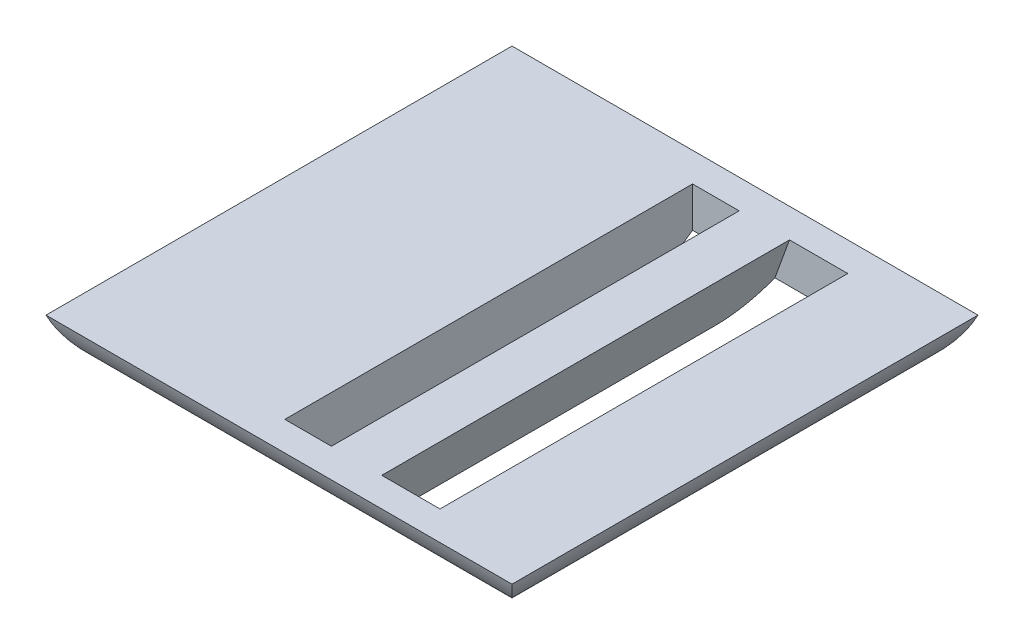
ISO-10303-21;
HEADER;
FILE_DESCRIPTION(('STEP AP214'),'2;1');
FILE_NAME('part.step','',(''),(''),'','','');
FILE_SCHEMA(('AUTOMOTIVE_DESIGN { 1 0 10303 214 1 1 1 1 }'));
ENDSEC;
DATA;
#1=APPLICATION_CONTEXT('core data for automotive mechanical design processes');
#2=APPLICATION_PROTOCOL_DEFINITION('international standard','automotive_design',2000,#1);
#3=PRODUCT_CONTEXT('',#1,'mechanical');
#4=PRODUCT('Part','Part','',(#3));
#5=PRODUCT_RELATED_PRODUCT_CATEGORY('part','',(#4));
#6=PRODUCT_DEFINITION_FORMATION('','',#4);
#7=PRODUCT_DEFINITION_CONTEXT('part definition',#1,'design');
#8=PRODUCT_DEFINITION('design','',#6,#7);
#9=PRODUCT_DEFINITION_SHAPE('','',#8);
#10=(LENGTH_UNIT() NAMED_UNIT(*) SI_UNIT(.MILLI.,.METRE.));
#11=(NAMED_UNIT(*) PLANE_ANGLE_UNIT() SI_UNIT($,.RADIAN.));
#12=(NAMED_UNIT(*) SI_UNIT($,.STERADIAN.) SOLID_ANGLE_UNIT());
#13=UNCERTAINTY_MEASURE_WITH_UNIT(LENGTH_MEASURE(1.E-05),#10,'distance_accuracy_value','');
#14=(GEOMETRIC_REPRESENTATION_CONTEXT(3) GLOBAL_UNCERTAINTY_ASSIGNED_CONTEXT((#13)) GLOBAL_UNIT_ASSIGNED_CONTEXT((#10,
#11,#12)) REPRESENTATION_CONTEXT('',''));
#15=CARTESIAN_POINT('',(0.,0.,0.));
#16=DIRECTION('',(0.,0.,1.));
#17=DIRECTION('',(1.,0.,0.));
#18=AXIS2_PLACEMENT_3D('',#15,#16,#17);
#19=CARTESIAN_POINT('',(0.,0.,0.));
#20=DIRECTION('',(0.,1.,0.));
#21=DIRECTION('',(0.,0.,1.));
#22=AXIS2_PLACEMENT_3D('',#19,#20,#21);
#23=PLANE('',#22);
#24=DIRECTION('',(0.,0.,1.));
#25=VECTOR('',#24,1.);
#26=CARTESIAN_POINT('',(4.,0.,-35.));
#27=LINE('',#26,#25);
#28=CARTESIAN_POINT('',(4.,0.,-25.857864376269));
#29=VERTEX_POINT('',#28);
#30=CARTESIAN_POINT('',(4.,0.,25.8578643762691));
#31=VERTEX_POINT('',#30);
#32=EDGE_CURVE('E189',#29,#31,#27,.T.);
#33=ORIENTED_EDGE('',*,*,#32,.F.);
#34=DIRECTION('',(-1.,0.,0.));
#35=VECTOR('',#34,1.);
#36=CARTESIAN_POINT('',(0.,0.,-25.857864376269));
#37=LINE('',#36,#35);
#38=CARTESIAN_POINT('',(9.,0.,-25.857864376269));
#39=VERTEX_POINT('',#38);
#40=EDGE_CURVE('E237',#29,#39,#37,.F.);
#41=ORIENTED_EDGE('',*,*,#40,.T.);
#42=DIRECTION('',(0.,0.,-1.));
#43=VECTOR('',#42,1.);
#44=CARTESIAN_POINT('',(9.00000000000001,0.,35.0000000000001));
#45=LINE('',#44,#43);
#46=CARTESIAN_POINT('',(9.00000000000001,0.,25.8578643762691));
#47=VERTEX_POINT('',#46);
#48=EDGE_CURVE('E171',#47,#39,#45,.T.);
#49=ORIENTED_EDGE('',*,*,#48,.F.);
#50=DIRECTION('',(1.,0.,0.));
#51=VECTOR('',#50,1.);
#52=CARTESIAN_POINT('',(0.,0.,25.8578643762691));
#53=LINE('',#52,#51);
#54=EDGE_CURVE('E229',#47,#31,#53,.F.);
#55=ORIENTED_EDGE('',*,*,#54,.T.);
#56=EDGE_LOOP('',(#33,#41,#49,#55));
#57=FACE_BOUND('',#56,.T.);
#58=ADVANCED_FACE('F35',(#57),#23,.F.);
#59=DIRECTION('',(0.,0.,-1.));
#60=VECTOR('',#59,1.);
#61=CARTESIAN_POINT('',(19.,0.,35.0000000000001));
#62=LINE('',#61,#60);
#63=CARTESIAN_POINT('',(19.,0.,25.8578643762691));
#64=VERTEX_POINT('',#63);
#65=CARTESIAN_POINT('',(19.,0.,-25.857864376269));
#66=VERTEX_POINT('',#65);
#67=EDGE_CURVE('E181',#64,#66,#62,.T.);
#68=ORIENTED_EDGE('',*,*,#67,.T.);
#69=DIRECTION('',(-1.,0.,0.));
#70=VECTOR('',#69,1.);
#71=CARTESIAN_POINT('',(0.,0.,-25.857864376269));
#72=LINE('',#71,#70);
#73=CARTESIAN_POINT('',(25.8578643762691,0.,-25.857864376269));
#74=VERTEX_POINT('',#73);
#75=EDGE_CURVE('E235',#66,#74,#72,.F.);
#76=ORIENTED_EDGE('',*,*,#75,.T.);
#77=DIRECTION('',(0.,0.,-1.));
#78=VECTOR('',#77,1.);
#79=CARTESIAN_POINT('',(25.8578643762691,0.,0.));
#80=LINE('',#79,#78);
#81=CARTESIAN_POINT('',(25.8578643762691,0.,25.8578643762691));
#82=VERTEX_POINT('',#81);
#83=EDGE_CURVE('E233',#74,#82,#80,.F.);
#84=ORIENTED_EDGE('',*,*,#83,.T.);
#85=DIRECTION('',(1.,0.,0.));
#86=VECTOR('',#85,1.);
#87=CARTESIAN_POINT('',(0.,0.,25.8578643762691));
#88=LINE('',#87,#86);
#89=EDGE_CURVE('E231',#82,#64,#88,.F.);
#90=ORIENTED_EDGE('',*,*,#89,.T.);
#91=EDGE_LOOP('',(#68,#76,#84,#90));
#92=FACE_BOUND('',#91,.T.);
#93=ADVANCED_FACE('F282',(#92),#23,.F.);
#94=CARTESIAN_POINT('',(19.,0.,35.0000000000001));
#95=DIRECTION('',(0.939692620785907,-0.342020143325673,0.));
#96=DIRECTION('',(0.342020143325673,0.939692620785907,0.));
#97=AXIS2_PLACEMENT_3D('',#94,#95,#96);
#98=PLANE('',#97);
#99=DIRECTION('',(-0.342020143325673,-0.939692620785907,0.));
#100=VECTOR('',#99,1.);
#101=CARTESIAN_POINT('',(22.6397023426621,10.,-35.));
#102=LINE('',#101,#100);
#103=CARTESIAN_POINT('',(22.6397023426621,10.,-35.));
#104=VERTEX_POINT('',#103);
#105=CARTESIAN_POINT('',(20.1311935916073,3.10792884997279,-35.));
#106=VERTEX_POINT('',#105);
#107=EDGE_CURVE('E160',#104,#106,#102,.T.);
#108=ORIENTED_EDGE('',*,*,#107,.T.);
#109=CARTESIAN_POINT('',(24.4595535139931,15.,-25.857864376269));
#110=DIRECTION('',(0.939692620785907,-0.342020143325673,0.));
#111=DIRECTION('',(-0.342020143325673,-0.939692620785907,0.));
#112=AXIS2_PLACEMENT_3D('',#109,#110,#111);
#113=ELLIPSE('',#112,15.9626665871387,15.);
#114=EDGE_CURVE('E255',#106,#66,#113,.F.);
#115=ORIENTED_EDGE('',*,*,#114,.T.);
#116=ORIENTED_EDGE('',*,*,#67,.F.);
#117=CARTESIAN_POINT('',(24.4595535139931,15.,25.8578643762691));
#118=DIRECTION('',(0.939692620785907,-0.342020143325673,0.));
#119=DIRECTION('',(0.342020143325673,0.939692620785907,0.));
#120=AXIS2_PLACEMENT_3D('',#117,#118,#119);
#121=ELLIPSE('',#120,15.9626665871387,15.);
#122=CARTESIAN_POINT('',(20.1311935916073,3.10792884997281,35.0000000000001));
#123=VERTEX_POINT('',#122);
#124=EDGE_CURVE('E52',#64,#123,#121,.F.);
#125=ORIENTED_EDGE('',*,*,#124,.T.);
#126=DIRECTION('',(-0.342020143325673,-0.939692620785907,0.));
#127=VECTOR('',#126,1.);
#128=CARTESIAN_POINT('',(19.,0.,35.0000000000001));
#129=LINE('',#128,#127);
#130=CARTESIAN_POINT('',(22.6397023426621,10.,35.));
#131=VERTEX_POINT('',#130);
#132=EDGE_CURVE('E176',#131,#123,#129,.T.);
#133=ORIENTED_EDGE('',*,*,#132,.F.);
#134=DIRECTION('',(0.,0.,-1.));
#135=VECTOR('',#134,1.);
#136=CARTESIAN_POINT('',(22.6397023426621,10.,35.));
#137=LINE('',#136,#135);
#138=EDGE_CURVE('E170',#131,#104,#137,.T.);
#139=ORIENTED_EDGE('',*,*,#138,.T.);
#140=EDGE_LOOP('',(#108,#115,#116,#125,#133,#139));
#141=FACE_BOUND('',#140,.T.);
#142=ADVANCED_FACE('F276',(#141),#98,.F.);
#143=CARTESIAN_POINT('',(9.00000000000001,0.,35.0000000000001));
#144=DIRECTION('',(-0.939692620785907,0.342020143325673,0.));
#145=DIRECTION('',(-0.342020143325673,-0.939692620785907,0.));
#146=AXIS2_PLACEMENT_3D('',#143,#144,#145);
#147=PLANE('',#146);
#148=ORIENTED_EDGE('',*,*,#48,.T.);
#149=CARTESIAN_POINT('',(14.4595535139931,15.,-25.857864376269));
#150=DIRECTION('',(-0.939692620785907,0.342020143325673,0.));
#151=DIRECTION('',(-0.342020143325673,-0.939692620785907,0.));
#152=AXIS2_PLACEMENT_3D('',#149,#150,#151);
#153=ELLIPSE('',#152,15.9626665871387,15.);
#154=CARTESIAN_POINT('',(10.1311935916073,3.10792884997278,-35.));
#155=VERTEX_POINT('',#154);
#156=EDGE_CURVE('E251',#39,#155,#153,.F.);
#157=ORIENTED_EDGE('',*,*,#156,.T.);
#158=DIRECTION('',(0.342020143325673,0.939692620785907,0.));
#159=VECTOR('',#158,1.);
#160=CARTESIAN_POINT('',(9.,0.,-35.));
#161=LINE('',#160,#159);
#162=CARTESIAN_POINT('',(12.6397023426621,10.,-35.));
#163=VERTEX_POINT('',#162);
#164=EDGE_CURVE('E166',#155,#163,#161,.T.);
#165=ORIENTED_EDGE('',*,*,#164,.T.);
#166=DIRECTION('',(0.,0.,-1.));
#167=VECTOR('',#166,1.);
#168=CARTESIAN_POINT('',(12.6397023426621,10.,35.0000000000001));
#169=LINE('',#168,#167);
#170=CARTESIAN_POINT('',(12.6397023426621,10.,35.0000000000001));
#171=VERTEX_POINT('',#170);
#172=EDGE_CURVE('E163',#171,#163,#169,.T.);
#173=ORIENTED_EDGE('',*,*,#172,.F.);
#174=DIRECTION('',(0.342020143325673,0.939692620785907,0.));
#175=VECTOR('',#174,1.);
#176=CARTESIAN_POINT('',(9.00000000000001,0.,35.0000000000001));
#177=LINE('',#176,#175);
#178=CARTESIAN_POINT('',(10.1311935916073,3.10792884997282,35.0000000000001));
#179=VERTEX_POINT('',#178);
#180=EDGE_CURVE('E152',#179,#171,#177,.T.);
#181=ORIENTED_EDGE('',*,*,#180,.F.);
#182=CARTESIAN_POINT('',(14.4595535139931,15.,25.8578643762691));
#183=DIRECTION('',(-0.939692620785907,0.342020143325673,0.));
#184=DIRECTION('',(0.342020143325673,0.939692620785907,0.));
#185=AXIS2_PLACEMENT_3D('',#182,#183,#184);
#186=ELLIPSE('',#185,15.9626665871387,15.);
#187=EDGE_CURVE('E249',#179,#47,#186,.F.);
#188=ORIENTED_EDGE('',*,*,#187,.T.);
#189=EDGE_LOOP('',(#148,#157,#165,#173,#181,#188));
#190=FACE_BOUND('',#189,.T.);
#191=ADVANCED_FACE('F165',(#190),#147,.F.);
#192=CARTESIAN_POINT('',(0.,10.,0.));
#193=DIRECTION('',(0.,1.,0.));
#194=DIRECTION('',(0.,0.,1.));
#195=AXIS2_PLACEMENT_3D('',#192,#193,#194);
#196=PLANE('',#195);
#197=DIRECTION('',(-1.,0.,0.));
#198=VECTOR('',#197,1.);
#199=CARTESIAN_POINT('',(40.,10.,-40.));
#200=LINE('',#199,#198);
#201=CARTESIAN_POINT('',(40.,10.,-40.));
#202=VERTEX_POINT('',#201);
#203=CARTESIAN_POINT('',(-40.,10.,-40.));
#204=VERTEX_POINT('',#203);
#205=EDGE_CURVE('E220',#202,#204,#200,.T.);
#206=ORIENTED_EDGE('',*,*,#205,.T.);
#207=DIRECTION('',(0.,0.,1.));
#208=VECTOR('',#207,1.);
#209=CARTESIAN_POINT('',(-40.,10.,40.));
#210=LINE('',#209,#208);
#211=CARTESIAN_POINT('',(-40.,10.,40.));
#212=VERTEX_POINT('',#211);
#213=EDGE_CURVE('E213',#204,#212,#210,.T.);
#214=ORIENTED_EDGE('',*,*,#213,.T.);
#215=DIRECTION('',(1.,0.,0.));
#216=VECTOR('',#215,1.);
#217=CARTESIAN_POINT('',(40.,10.,40.));
#218=LINE('',#217,#216);
#219=CARTESIAN_POINT('',(40.,10.,40.));
#220=VERTEX_POINT('',#219);
#221=EDGE_CURVE('E216',#212,#220,#218,.T.);
#222=ORIENTED_EDGE('',*,*,#221,.T.);
#223=DIRECTION('',(0.,0.,-1.));
#224=VECTOR('',#223,1.);
#225=CARTESIAN_POINT('',(40.,10.,40.));
#226=LINE('',#225,#224);
#227=EDGE_CURVE('E218',#220,#202,#226,.T.);
#228=ORIENTED_EDGE('',*,*,#227,.T.);
#229=EDGE_LOOP('',(#206,#214,#222,#228));
#230=FACE_BOUND('',#229,.T.);
#231=ORIENTED_EDGE('',*,*,#138,.F.);
#232=DIRECTION('',(1.,0.,0.));
#233=VECTOR('',#232,1.);
#234=CARTESIAN_POINT('',(12.6397023426621,10.,35.0000000000001));
#235=LINE('',#234,#233);
#236=EDGE_CURVE('E156',#171,#131,#235,.T.);
#237=ORIENTED_EDGE('',*,*,#236,.F.);
#238=ORIENTED_EDGE('',*,*,#172,.T.);
#239=DIRECTION('',(1.,0.,0.));
#240=VECTOR('',#239,1.);
#241=CARTESIAN_POINT('',(12.6397023426621,10.,-35.));
#242=LINE('',#241,#240);
#243=EDGE_CURVE('E272',#163,#104,#242,.T.);
#244=ORIENTED_EDGE('',*,*,#243,.T.);
#245=EDGE_LOOP('',(#231,#237,#238,#244));
#246=FACE_BOUND('',#245,.T.);
#247=DIRECTION('',(0.,0.,1.));
#248=VECTOR('',#247,1.);
#249=CARTESIAN_POINT('',(-4.,10.,0.));
#250=LINE('',#249,#248);
#251=CARTESIAN_POINT('',(-4.,10.,-35.));
#252=VERTEX_POINT('',#251);
#253=CARTESIAN_POINT('',(-4.,10.,35.));
#254=VERTEX_POINT('',#253);
#255=EDGE_CURVE('E211',#252,#254,#250,.T.);
#256=ORIENTED_EDGE('',*,*,#255,.F.);
#257=DIRECTION('',(-1.,0.,0.));
#258=VECTOR('',#257,1.);
#259=CARTESIAN_POINT('',(0.,10.,-35.));
#260=LINE('',#259,#258);
#261=CARTESIAN_POINT('',(4.,10.,-35.));
#262=VERTEX_POINT('',#261);
#263=EDGE_CURVE('E196',#262,#252,#260,.T.);
#264=ORIENTED_EDGE('',*,*,#263,.F.);
#265=DIRECTION('',(0.,0.,-1.));
#266=VECTOR('',#265,1.);
#267=CARTESIAN_POINT('',(4.,10.,0.));
#268=LINE('',#267,#266);
#269=CARTESIAN_POINT('',(4.,10.,35.));
#270=VERTEX_POINT('',#269);
#271=EDGE_CURVE('E206',#270,#262,#268,.T.);
#272=ORIENTED_EDGE('',*,*,#271,.F.);
#273=DIRECTION('',(1.,0.,0.));
#274=VECTOR('',#273,1.);
#275=CARTESIAN_POINT('',(0.,10.,35.));
#276=LINE('',#275,#274);
#277=EDGE_CURVE('E209',#254,#270,#276,.T.);
#278=ORIENTED_EDGE('',*,*,#277,.F.);
#279=EDGE_LOOP('',(#256,#264,#272,#278));
#280=FACE_BOUND('',#279,.T.);
#281=ADVANCED_FACE('F174',(#230,#246,#280),#196,.T.);
#282=DIRECTION('',(0.,0.,1.));
#283=VECTOR('',#282,1.);
#284=CARTESIAN_POINT('',(-25.857864376269,0.,0.));
#285=LINE('',#284,#283);
#286=CARTESIAN_POINT('',(-25.857864376269,0.,25.8578643762691));
#287=VERTEX_POINT('',#286);
#288=CARTESIAN_POINT('',(-25.857864376269,0.,-25.857864376269));
#289=VERTEX_POINT('',#288);
#290=EDGE_CURVE('E224',#287,#289,#285,.F.);
#291=ORIENTED_EDGE('',*,*,#290,.T.);
#292=DIRECTION('',(-1.,0.,0.));
#293=VECTOR('',#292,1.);
#294=CARTESIAN_POINT('',(0.,0.,-25.857864376269));
#295=LINE('',#294,#293);
#296=CARTESIAN_POINT('',(-4.,0.,-25.857864376269));
#297=VERTEX_POINT('',#296);
#298=EDGE_CURVE('E227',#289,#297,#295,.F.);
#299=ORIENTED_EDGE('',*,*,#298,.T.);
#300=DIRECTION('',(0.,0.,-1.));
#301=VECTOR('',#300,1.);
#302=CARTESIAN_POINT('',(-4.,0.,-35.));
#303=LINE('',#302,#301);
#304=CARTESIAN_POINT('',(-4.,0.,25.8578643762691));
#305=VERTEX_POINT('',#304);
#306=EDGE_CURVE('E184',#305,#297,#303,.T.);
#307=ORIENTED_EDGE('',*,*,#306,.F.);
#308=DIRECTION('',(1.,0.,0.));
#309=VECTOR('',#308,1.);
#310=CARTESIAN_POINT('',(0.,0.,25.8578643762691));
#311=LINE('',#310,#309);
#312=EDGE_CURVE('E222',#305,#287,#311,.F.);
#313=ORIENTED_EDGE('',*,*,#312,.T.);
#314=EDGE_LOOP('',(#291,#299,#307,#313));
#315=FACE_BOUND('',#314,.T.);
#316=ADVANCED_FACE('F305',(#315),#23,.F.);
#317=CARTESIAN_POINT('',(-4.,20.,-35.));
#318=DIRECTION('',(-1.,0.,0.));
#319=DIRECTION('',(0.,0.,1.));
#320=AXIS2_PLACEMENT_3D('',#317,#318,#319);
#321=PLANE('',#320);
#322=ORIENTED_EDGE('',*,*,#306,.T.);
#323=CARTESIAN_POINT('',(-4.,15.,-25.857864376269));
#324=DIRECTION('',(-1.,0.,0.));
#325=DIRECTION('',(0.,0.,1.));
#326=AXIS2_PLACEMENT_3D('',#323,#324,#325);
#327=CIRCLE('',#326,15.);
#328=CARTESIAN_POINT('',(-4.,3.10792884997281,-35.));
#329=VERTEX_POINT('',#328);
#330=EDGE_CURVE('E241',#297,#329,#327,.F.);
#331=ORIENTED_EDGE('',*,*,#330,.T.);
#332=DIRECTION('',(0.,-1.,0.));
#333=VECTOR('',#332,1.);
#334=CARTESIAN_POINT('',(-4.,20.,-35.));
#335=LINE('',#334,#333);
#336=EDGE_CURVE('E192',#252,#329,#335,.T.);
#337=ORIENTED_EDGE('',*,*,#336,.F.);
#338=ORIENTED_EDGE('',*,*,#255,.T.);
#339=DIRECTION('',(0.,-1.,0.));
#340=VECTOR('',#339,1.);
#341=CARTESIAN_POINT('',(-4.,20.,35.));
#342=LINE('',#341,#340);
#343=CARTESIAN_POINT('',(-4.,3.10792884997277,35.));
#344=VERTEX_POINT('',#343);
#345=EDGE_CURVE('E193',#254,#344,#342,.T.);
#346=ORIENTED_EDGE('',*,*,#345,.T.);
#347=CARTESIAN_POINT('',(-4.,15.,25.8578643762691));
#348=DIRECTION('',(-1.,0.,0.));
#349=DIRECTION('',(0.,0.,1.));
#350=AXIS2_PLACEMENT_3D('',#347,#348,#349);
#351=CIRCLE('',#350,15.);
#352=EDGE_CURVE('E239',#344,#305,#351,.F.);
#353=ORIENTED_EDGE('',*,*,#352,.T.);
#354=EDGE_LOOP('',(#322,#331,#337,#338,#346,#353));
#355=FACE_BOUND('',#354,.T.);
#356=ADVANCED_FACE('F312',(#355),#321,.F.);
#357=CARTESIAN_POINT('',(4.,20.,35.));
#358=DIRECTION('',(0.,0.,1.));
#359=DIRECTION('',(1.,0.,0.));
#360=AXIS2_PLACEMENT_3D('',#357,#358,#359);
#361=PLANE('',#360);
#362=DIRECTION('',(0.,-1.,0.));
#363=VECTOR('',#362,1.);
#364=CARTESIAN_POINT('',(4.,20.,35.));
#365=LINE('',#364,#363);
#366=CARTESIAN_POINT('',(4.,3.10792884997277,35.));
#367=VERTEX_POINT('',#366);
#368=EDGE_CURVE('E197',#270,#367,#365,.T.);
#369=ORIENTED_EDGE('',*,*,#368,.T.);
#370=DIRECTION('',(1.,0.,0.));
#371=VECTOR('',#370,1.);
#372=CARTESIAN_POINT('',(4.,3.10792884997277,35.));
#373=LINE('',#372,#371);
#374=EDGE_CURVE('E11',#367,#344,#373,.F.);
#375=ORIENTED_EDGE('',*,*,#374,.T.);
#376=ORIENTED_EDGE('',*,*,#345,.F.);
#377=ORIENTED_EDGE('',*,*,#277,.T.);
#378=EDGE_LOOP('',(#369,#375,#376,#377));
#379=FACE_BOUND('',#378,.T.);
#380=ADVANCED_FACE('F318',(#379),#361,.F.);
#381=CARTESIAN_POINT('',(4.,20.,-35.));
#382=DIRECTION('',(1.,0.,0.));
#383=DIRECTION('',(0.,0.,-1.));
#384=AXIS2_PLACEMENT_3D('',#381,#382,#383);
#385=PLANE('',#384);
#386=DIRECTION('',(0.,-1.,0.));
#387=VECTOR('',#386,1.);
#388=CARTESIAN_POINT('',(4.,20.,-35.));
#389=LINE('',#388,#387);
#390=CARTESIAN_POINT('',(4.,3.10792884997281,-35.));
#391=VERTEX_POINT('',#390);
#392=EDGE_CURVE('E200',#262,#391,#389,.T.);
#393=ORIENTED_EDGE('',*,*,#392,.T.);
#394=CARTESIAN_POINT('',(4.,15.,-25.857864376269));
#395=DIRECTION('',(1.,0.,0.));
#396=DIRECTION('',(0.,0.,-1.));
#397=AXIS2_PLACEMENT_3D('',#394,#395,#396);
#398=CIRCLE('',#397,15.);
#399=EDGE_CURVE('E247',#391,#29,#398,.F.);
#400=ORIENTED_EDGE('',*,*,#399,.T.);
#401=ORIENTED_EDGE('',*,*,#32,.T.);
#402=CARTESIAN_POINT('',(4.,15.,25.8578643762691));
#403=DIRECTION('',(1.,0.,0.));
#404=DIRECTION('',(0.,0.,-1.));
#405=AXIS2_PLACEMENT_3D('',#402,#403,#404);
#406=CIRCLE('',#405,15.);
#407=EDGE_CURVE('E245',#31,#367,#406,.F.);
#408=ORIENTED_EDGE('',*,*,#407,.T.);
#409=ORIENTED_EDGE('',*,*,#368,.F.);
#410=ORIENTED_EDGE('',*,*,#271,.T.);
#411=EDGE_LOOP('',(#393,#400,#401,#408,#409,#410));
#412=FACE_BOUND('',#411,.T.);
#413=ADVANCED_FACE('F343',(#412),#385,.F.);
#414=CARTESIAN_POINT('',(4.,20.,-35.));
#415=DIRECTION('',(0.,0.,-1.));
#416=DIRECTION('',(-1.,0.,0.));
#417=AXIS2_PLACEMENT_3D('',#414,#415,#416);
#418=PLANE('',#417);
#419=ORIENTED_EDGE('',*,*,#336,.T.);
#420=DIRECTION('',(-1.,0.,0.));
#421=VECTOR('',#420,1.);
#422=CARTESIAN_POINT('',(-4.,3.10792884997281,-35.));
#423=LINE('',#422,#421);
#424=EDGE_CURVE('E243',#329,#391,#423,.F.);
#425=ORIENTED_EDGE('',*,*,#424,.T.);
#426=ORIENTED_EDGE('',*,*,#392,.F.);
#427=ORIENTED_EDGE('',*,*,#263,.T.);
#428=EDGE_LOOP('',(#419,#425,#426,#427));
#429=FACE_BOUND('',#428,.T.);
#430=ADVANCED_FACE('F301',(#429),#418,.F.);
#431=CARTESIAN_POINT('',(0.,0.,35.0000000000001));
#432=DIRECTION('',(0.,0.,1.));
#433=DIRECTION('',(0.,-1.,0.));
#434=AXIS2_PLACEMENT_3D('',#431,#432,#433);
#435=PLANE('',#434);
#436=ORIENTED_EDGE('',*,*,#132,.T.);
#437=DIRECTION('',(1.,0.,0.));
#438=VECTOR('',#437,1.);
#439=CARTESIAN_POINT('',(20.1311935916073,3.10792884997281,35.));
#440=LINE('',#439,#438);
#441=EDGE_CURVE('E44',#123,#179,#440,.F.);
#442=ORIENTED_EDGE('',*,*,#441,.T.);
#443=ORIENTED_EDGE('',*,*,#180,.T.);
#444=ORIENTED_EDGE('',*,*,#236,.T.);
#445=EDGE_LOOP('',(#436,#442,#443,#444));
#446=FACE_BOUND('',#445,.T.);
#447=ADVANCED_FACE('F154',(#446),#435,.F.);
#448=CARTESIAN_POINT('',(0.,0.,-35.));
#449=DIRECTION('',(0.,0.,-1.));
#450=DIRECTION('',(-1.,0.,0.));
#451=AXIS2_PLACEMENT_3D('',#448,#449,#450);
#452=PLANE('',#451);
#453=ORIENTED_EDGE('',*,*,#164,.F.);
#454=DIRECTION('',(-1.,0.,0.));
#455=VECTOR('',#454,1.);
#456=CARTESIAN_POINT('',(10.1311935916073,3.10792884997278,-35.));
#457=LINE('',#456,#455);
#458=EDGE_CURVE('E60',#155,#106,#457,.F.);
#459=ORIENTED_EDGE('',*,*,#458,.T.);
#460=ORIENTED_EDGE('',*,*,#107,.F.);
#461=ORIENTED_EDGE('',*,*,#243,.F.);
#462=EDGE_LOOP('',(#453,#459,#460,#461));
#463=FACE_BOUND('',#462,.T.);
#464=ADVANCED_FACE('F294',(#463),#452,.F.);
#465=CARTESIAN_POINT('',(25.8578643762691,15.,40.));
#466=DIRECTION('',(0.,0.,-1.));
#467=DIRECTION('',(-1.,0.,0.));
#468=AXIS2_PLACEMENT_3D('',#465,#466,#467);
#469=CYLINDRICAL_SURFACE('',#468,15.);
#470=CARTESIAN_POINT('',(25.8578643762691,15.,25.8578643762691));
#471=DIRECTION('',(0.707106781186547,0.,-0.707106781186548));
#472=DIRECTION('',(0.707106781186548,0.,0.707106781186547));
#473=AXIS2_PLACEMENT_3D('',#470,#471,#472);
#474=ELLIPSE('',#473,21.2132034355964,15.);
#475=EDGE_CURVE('E261',#82,#220,#474,.F.);
#476=ORIENTED_EDGE('',*,*,#475,.F.);
#477=ORIENTED_EDGE('',*,*,#83,.F.);
#478=CARTESIAN_POINT('',(25.8578643762691,15.,-25.857864376269));
#479=DIRECTION('',(-0.707106781186548,0.,-0.707106781186547));
#480=DIRECTION('',(0.707106781186547,0.,-0.707106781186548));
#481=AXIS2_PLACEMENT_3D('',#478,#479,#480);
#482=ELLIPSE('',#481,21.2132034355964,15.);
#483=EDGE_CURVE('E39',#202,#74,#482,.T.);
#484=ORIENTED_EDGE('',*,*,#483,.F.);
#485=ORIENTED_EDGE('',*,*,#227,.F.);
#486=EDGE_LOOP('',(#476,#477,#484,#485));
#487=FACE_BOUND('',#486,.T.);
#488=ADVANCED_FACE('F37',(#487),#469,.T.);
#489=CARTESIAN_POINT('',(40.,15.,-25.857864376269));
#490=DIRECTION('',(-1.,0.,0.));
#491=DIRECTION('',(0.,0.,1.));
#492=AXIS2_PLACEMENT_3D('',#489,#490,#491);
#493=CYLINDRICAL_SURFACE('',#492,15.);
#494=ORIENTED_EDGE('',*,*,#330,.F.);
#495=ORIENTED_EDGE('',*,*,#298,.F.);
#496=CARTESIAN_POINT('',(-25.857864376269,15.,-25.857864376269));
#497=DIRECTION('',(-0.707106781186547,0.,0.707106781186548));
#498=DIRECTION('',(-0.707106781186548,0.,-0.707106781186547));
#499=AXIS2_PLACEMENT_3D('',#496,#497,#498);
#500=ELLIPSE('',#499,21.2132034355964,15.);
#501=EDGE_CURVE('E260',#204,#289,#500,.T.);
#502=ORIENTED_EDGE('',*,*,#501,.F.);
#503=ORIENTED_EDGE('',*,*,#205,.F.);
#504=ORIENTED_EDGE('',*,*,#483,.T.);
#505=ORIENTED_EDGE('',*,*,#75,.F.);
#506=ORIENTED_EDGE('',*,*,#114,.F.);
#507=ORIENTED_EDGE('',*,*,#458,.F.);
#508=ORIENTED_EDGE('',*,*,#156,.F.);
#509=ORIENTED_EDGE('',*,*,#40,.F.);
#510=ORIENTED_EDGE('',*,*,#399,.F.);
#511=ORIENTED_EDGE('',*,*,#424,.F.);
#512=EDGE_LOOP('',(#494,#495,#502,#503,#504,#505,#506,#507,#508,#509,#510,#511));
#513=FACE_BOUND('',#512,.T.);
#514=ADVANCED_FACE('F278',(#513),#493,.T.);
#515=CARTESIAN_POINT('',(40.,15.,25.8578643762691));
#516=DIRECTION('',(1.,0.,0.));
#517=DIRECTION('',(0.,0.,-1.));
#518=AXIS2_PLACEMENT_3D('',#515,#516,#517);
#519=CYLINDRICAL_SURFACE('',#518,15.);
#520=ORIENTED_EDGE('',*,*,#475,.T.);
#521=ORIENTED_EDGE('',*,*,#221,.F.);
#522=CARTESIAN_POINT('',(-25.857864376269,15.,25.8578643762691));
#523=DIRECTION('',(0.707106781186548,0.,0.707106781186547));
#524=DIRECTION('',(0.707106781186547,0.,-0.707106781186548));
#525=AXIS2_PLACEMENT_3D('',#522,#523,#524);
#526=ELLIPSE('',#525,21.2132034355964,15.);
#527=EDGE_CURVE('E258',#287,#212,#526,.F.);
#528=ORIENTED_EDGE('',*,*,#527,.F.);
#529=ORIENTED_EDGE('',*,*,#312,.F.);
#530=ORIENTED_EDGE('',*,*,#352,.F.);
#531=ORIENTED_EDGE('',*,*,#374,.F.);
#532=ORIENTED_EDGE('',*,*,#407,.F.);
#533=ORIENTED_EDGE('',*,*,#54,.F.);
#534=ORIENTED_EDGE('',*,*,#187,.F.);
#535=ORIENTED_EDGE('',*,*,#441,.F.);
#536=ORIENTED_EDGE('',*,*,#124,.F.);
#537=ORIENTED_EDGE('',*,*,#89,.F.);
#538=EDGE_LOOP('',(#520,#521,#528,#529,#530,#531,#532,#533,#534,#535,#536,#537));
#539=FACE_BOUND('',#538,.T.);
#540=ADVANCED_FACE('F285',(#539),#519,.T.);
#541=CARTESIAN_POINT('',(-25.857864376269,15.,40.));
#542=DIRECTION('',(0.,0.,1.));
#543=DIRECTION('',(1.,0.,0.));
#544=AXIS2_PLACEMENT_3D('',#541,#542,#543);
#545=CYLINDRICAL_SURFACE('',#544,15.);
#546=ORIENTED_EDGE('',*,*,#501,.T.);
#547=ORIENTED_EDGE('',*,*,#290,.F.);
#548=ORIENTED_EDGE('',*,*,#527,.T.);
#549=ORIENTED_EDGE('',*,*,#213,.F.);
#550=EDGE_LOOP('',(#546,#547,#548,#549));
#551=FACE_BOUND('',#550,.T.);
#552=ADVANCED_FACE('F328',(#551),#545,.T.);
#553=CLOSED_SHELL('',(#58,#93,#142,#191,#281,#316,#356,#380,#413,#430,#447,#464,#488,#514,#540,#552));
#554=MANIFOLD_SOLID_BREP('B2',#553);
#555=ADVANCED_BREP_SHAPE_REPRESENTATION('',(#18,#554),#14);
#556=SHAPE_DEFINITION_REPRESENTATION(#9,#555);
ENDSEC;
END-ISO-10303-21;
